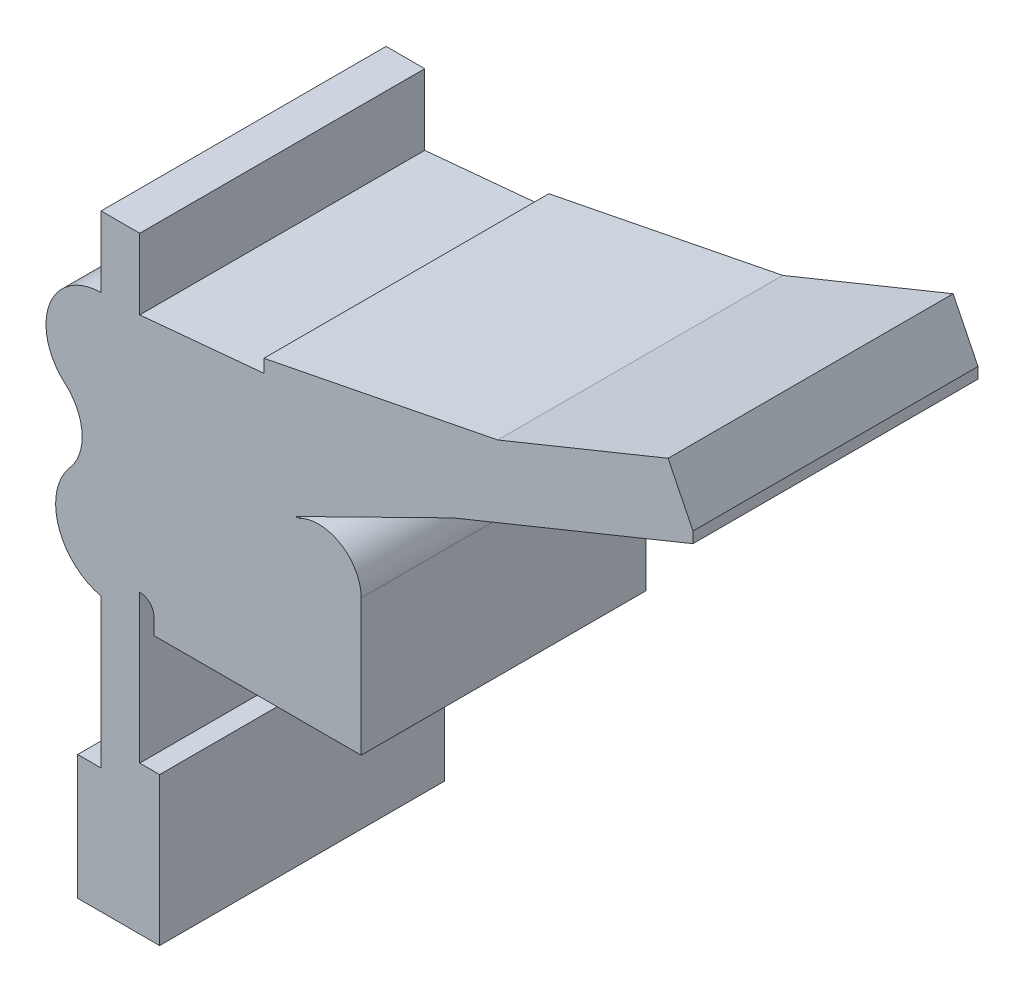
ISO-10303-21;
HEADER;
FILE_DESCRIPTION(('STEP AP214'),'2;1');
FILE_NAME('part.step','',(''),(''),'','','');
FILE_SCHEMA(('AUTOMOTIVE_DESIGN { 1 0 10303 214 1 1 1 1 }'));
ENDSEC;
DATA;
#1=APPLICATION_CONTEXT('core data for automotive mechanical design processes');
#2=APPLICATION_PROTOCOL_DEFINITION('international standard','automotive_design',2000,#1);
#3=PRODUCT_CONTEXT('',#1,'mechanical');
#4=PRODUCT('Part','Part','',(#3));
#5=PRODUCT_RELATED_PRODUCT_CATEGORY('part','',(#4));
#6=PRODUCT_DEFINITION_FORMATION('','',#4);
#7=PRODUCT_DEFINITION_CONTEXT('part definition',#1,'design');
#8=PRODUCT_DEFINITION('design','',#6,#7);
#9=PRODUCT_DEFINITION_SHAPE('','',#8);
#10=(LENGTH_UNIT() NAMED_UNIT(*) SI_UNIT(.MILLI.,.METRE.));
#11=(NAMED_UNIT(*) PLANE_ANGLE_UNIT() SI_UNIT($,.RADIAN.));
#12=(NAMED_UNIT(*) SI_UNIT($,.STERADIAN.) SOLID_ANGLE_UNIT());
#13=UNCERTAINTY_MEASURE_WITH_UNIT(LENGTH_MEASURE(1.E-05),#10,'distance_accuracy_value','');
#14=(GEOMETRIC_REPRESENTATION_CONTEXT(3) GLOBAL_UNCERTAINTY_ASSIGNED_CONTEXT((#13)) GLOBAL_UNIT_ASSIGNED_CONTEXT((#10,
#11,#12)) REPRESENTATION_CONTEXT('',''));
#15=CARTESIAN_POINT('',(0.,0.,0.));
#16=DIRECTION('',(0.,0.,1.));
#17=DIRECTION('',(1.,0.,0.));
#18=AXIS2_PLACEMENT_3D('',#15,#16,#17);
#19=CARTESIAN_POINT('',(141.836213574338,159.840975298499,59.));
#20=DIRECTION('',(-1.,0.,0.));
#21=DIRECTION('',(0.,0.,1.));
#22=AXIS2_PLACEMENT_3D('',#19,#20,#21);
#23=PLANE('',#22);
#24=DIRECTION('',(0.,1.,0.));
#25=VECTOR('',#24,1.);
#26=CARTESIAN_POINT('',(141.836213574338,159.840975298499,0.));
#27=LINE('',#26,#25);
#28=CARTESIAN_POINT('',(141.836213574338,159.840975298499,0.));
#29=VERTEX_POINT('',#28);
#30=CARTESIAN_POINT('',(141.836213574338,162.118956640308,0.));
#31=VERTEX_POINT('',#30);
#32=EDGE_CURVE('E245',#29,#31,#27,.T.);
#33=ORIENTED_EDGE('',*,*,#32,.T.);
#34=DIRECTION('',(0.,0.,-1.));
#35=VECTOR('',#34,1.);
#36=CARTESIAN_POINT('',(141.836213574338,162.118956640308,59.));
#37=LINE('',#36,#35);
#38=CARTESIAN_POINT('',(141.836213574338,162.118956640308,59.));
#39=VERTEX_POINT('',#38);
#40=EDGE_CURVE('E11',#39,#31,#37,.T.);
#41=ORIENTED_EDGE('',*,*,#40,.F.);
#42=DIRECTION('',(0.,1.,0.));
#43=VECTOR('',#42,1.);
#44=CARTESIAN_POINT('',(141.836213574338,159.840975298499,59.));
#45=LINE('',#44,#43);
#46=CARTESIAN_POINT('',(141.836213574338,159.840975298499,59.));
#47=VERTEX_POINT('',#46);
#48=EDGE_CURVE('E298',#47,#39,#45,.T.);
#49=ORIENTED_EDGE('',*,*,#48,.F.);
#50=DIRECTION('',(0.,0.,-1.));
#51=VECTOR('',#50,1.);
#52=CARTESIAN_POINT('',(141.836213574338,159.840975298499,59.));
#53=LINE('',#52,#51);
#54=EDGE_CURVE('E241',#47,#29,#53,.T.);
#55=ORIENTED_EDGE('',*,*,#54,.T.);
#56=EDGE_LOOP('',(#33,#41,#49,#55));
#57=FACE_BOUND('',#56,.T.);
#58=ADVANCED_FACE('F35',(#57),#23,.F.);
#59=CARTESIAN_POINT('',(141.836213574338,162.118956640308,59.));
#60=DIRECTION('',(-0.897170676040537,-0.441684025127654,0.));
#61=DIRECTION('',(0.441684025127654,-0.897170676040537,0.));
#62=AXIS2_PLACEMENT_3D('',#59,#60,#61);
#63=PLANE('',#62);
#64=DIRECTION('',(-0.441684025127654,0.897170676040537,0.));
#65=VECTOR('',#64,1.);
#66=CARTESIAN_POINT('',(141.836213574338,162.118956640308,0.));
#67=LINE('',#66,#65);
#68=CARTESIAN_POINT('',(136.686788286982,172.578726755251,0.));
#69=VERTEX_POINT('',#68);
#70=EDGE_CURVE('E248',#31,#69,#67,.T.);
#71=ORIENTED_EDGE('',*,*,#70,.T.);
#72=DIRECTION('',(0.,0.,-1.));
#73=VECTOR('',#72,1.);
#74=CARTESIAN_POINT('',(136.686788286982,172.578726755251,59.));
#75=LINE('',#74,#73);
#76=CARTESIAN_POINT('',(136.686788286982,172.578726755251,59.));
#77=VERTEX_POINT('',#76);
#78=EDGE_CURVE('E43',#77,#69,#75,.T.);
#79=ORIENTED_EDGE('',*,*,#78,.F.);
#80=DIRECTION('',(-0.441684025127654,0.897170676040537,0.));
#81=VECTOR('',#80,1.);
#82=CARTESIAN_POINT('',(141.836213574338,162.118956640308,59.));
#83=LINE('',#82,#81);
#84=EDGE_CURVE('E151',#39,#77,#83,.T.);
#85=ORIENTED_EDGE('',*,*,#84,.F.);
#86=ORIENTED_EDGE('',*,*,#40,.T.);
#87=EDGE_LOOP('',(#71,#79,#85,#86));
#88=FACE_BOUND('',#87,.T.);
#89=ADVANCED_FACE('F450',(#88),#63,.F.);
#90=CARTESIAN_POINT('',(136.686788286982,172.578726755251,59.));
#91=DIRECTION('',(0.376798129201933,-0.926295400954751,0.));
#92=DIRECTION('',(0.926295400954751,0.376798129201934,0.));
#93=AXIS2_PLACEMENT_3D('',#90,#91,#92);
#94=PLANE('',#93);
#95=DIRECTION('',(-0.926295400954751,-0.376798129201934,0.));
#96=VECTOR('',#95,1.);
#97=CARTESIAN_POINT('',(136.686788286982,172.578726755251,0.));
#98=LINE('',#97,#96);
#99=CARTESIAN_POINT('',(101.42242047089,158.233899169044,0.));
#100=VERTEX_POINT('',#99);
#101=EDGE_CURVE('E250',#69,#100,#98,.T.);
#102=ORIENTED_EDGE('',*,*,#101,.T.);
#103=DIRECTION('',(0.,0.,-1.));
#104=VECTOR('',#103,1.);
#105=CARTESIAN_POINT('',(101.42242047089,158.233899169044,59.));
#106=LINE('',#105,#104);
#107=CARTESIAN_POINT('',(101.42242047089,158.233899169044,59.));
#108=VERTEX_POINT('',#107);
#109=EDGE_CURVE('E362',#108,#100,#106,.T.);
#110=ORIENTED_EDGE('',*,*,#109,.F.);
#111=DIRECTION('',(-0.926295400954751,-0.376798129201934,0.));
#112=VECTOR('',#111,1.);
#113=CARTESIAN_POINT('',(136.686788286982,172.578726755251,59.));
#114=LINE('',#113,#112);
#115=EDGE_CURVE('E370',#77,#108,#114,.T.);
#116=ORIENTED_EDGE('',*,*,#115,.F.);
#117=ORIENTED_EDGE('',*,*,#78,.T.);
#118=EDGE_LOOP('',(#102,#110,#116,#117));
#119=FACE_BOUND('',#118,.T.);
#120=ADVANCED_FACE('F368',(#119),#94,.F.);
#121=CARTESIAN_POINT('',(101.42242047089,158.233899169044,59.));
#122=DIRECTION('',(0.19378641821299,-0.981043742203262,0.));
#123=DIRECTION('',(0.981043742203262,0.19378641821299,0.));
#124=AXIS2_PLACEMENT_3D('',#121,#122,#123);
#125=PLANE('',#124);
#126=DIRECTION('',(-0.981043742203262,-0.19378641821299,0.));
#127=VECTOR('',#126,1.);
#128=CARTESIAN_POINT('',(101.42242047089,158.233899169044,0.));
#129=LINE('',#128,#127);
#130=CARTESIAN_POINT('',(53.0086273674414,148.670680778239,0.));
#131=VERTEX_POINT('',#130);
#132=EDGE_CURVE('E252',#100,#131,#129,.T.);
#133=ORIENTED_EDGE('',*,*,#132,.T.);
#134=DIRECTION('',(0.,0.,-1.));
#135=VECTOR('',#134,1.);
#136=CARTESIAN_POINT('',(53.0086273674414,148.670680778239,59.));
#137=LINE('',#136,#135);
#138=CARTESIAN_POINT('',(53.0086273674414,148.670680778239,59.));
#139=VERTEX_POINT('',#138);
#140=EDGE_CURVE('E359',#139,#131,#137,.T.);
#141=ORIENTED_EDGE('',*,*,#140,.F.);
#142=DIRECTION('',(-0.981043742203262,-0.19378641821299,0.));
#143=VECTOR('',#142,1.);
#144=CARTESIAN_POINT('',(101.42242047089,158.233899169044,59.));
#145=LINE('',#144,#143);
#146=EDGE_CURVE('E388',#108,#139,#145,.T.);
#147=ORIENTED_EDGE('',*,*,#146,.F.);
#148=ORIENTED_EDGE('',*,*,#109,.T.);
#149=EDGE_LOOP('',(#133,#141,#147,#148));
#150=FACE_BOUND('',#149,.T.);
#151=ADVANCED_FACE('F379',(#150),#125,.F.);
#152=CARTESIAN_POINT('',(53.0086273674414,148.670680778239,59.));
#153=DIRECTION('',(1.,0.,0.));
#154=DIRECTION('',(0.,0.,-1.));
#155=AXIS2_PLACEMENT_3D('',#152,#153,#154);
#156=PLANE('',#155);
#157=DIRECTION('',(0.,-1.,0.));
#158=VECTOR('',#157,1.);
#159=CARTESIAN_POINT('',(53.0086273674414,148.670680778239,0.));
#160=LINE('',#159,#158);
#161=CARTESIAN_POINT('',(53.0086273674414,145.981025605825,0.));
#162=VERTEX_POINT('',#161);
#163=EDGE_CURVE('E254',#131,#162,#160,.T.);
#164=ORIENTED_EDGE('',*,*,#163,.T.);
#165=DIRECTION('',(0.,0.,-1.));
#166=VECTOR('',#165,1.);
#167=CARTESIAN_POINT('',(53.0086273674414,145.981025605825,59.));
#168=LINE('',#167,#166);
#169=CARTESIAN_POINT('',(53.0086273674414,145.981025605825,59.));
#170=VERTEX_POINT('',#169);
#171=EDGE_CURVE('E356',#170,#162,#168,.T.);
#172=ORIENTED_EDGE('',*,*,#171,.F.);
#173=DIRECTION('',(0.,-1.,0.));
#174=VECTOR('',#173,1.);
#175=CARTESIAN_POINT('',(53.0086273674414,148.670680778239,59.));
#176=LINE('',#175,#174);
#177=EDGE_CURVE('E385',#139,#170,#176,.T.);
#178=ORIENTED_EDGE('',*,*,#177,.F.);
#179=ORIENTED_EDGE('',*,*,#140,.T.);
#180=EDGE_LOOP('',(#164,#172,#178,#179));
#181=FACE_BOUND('',#180,.T.);
#182=ADVANCED_FACE('F383',(#181),#156,.F.);
#183=CARTESIAN_POINT('',(53.0086273674414,145.981025605825,59.));
#184=DIRECTION('',(0.0926233689294972,-0.995701215992102,0.));
#185=DIRECTION('',(0.995701215992102,0.0926233689294973,0.));
#186=AXIS2_PLACEMENT_3D('',#183,#184,#185);
#187=PLANE('',#186);
#188=DIRECTION('',(-0.995701215992102,-0.0926233689294972,0.));
#189=VECTOR('',#188,1.);
#190=CARTESIAN_POINT('',(53.0086273674414,145.981025605825,0.));
#191=LINE('',#190,#189);
#192=CARTESIAN_POINT('',(27.307477942154,143.590221008124,0.));
#193=VERTEX_POINT('',#192);
#194=EDGE_CURVE('E256',#162,#193,#191,.T.);
#195=ORIENTED_EDGE('',*,*,#194,.T.);
#196=DIRECTION('',(0.,0.,-1.));
#197=VECTOR('',#196,1.);
#198=CARTESIAN_POINT('',(27.307477942154,143.590221008124,59.));
#199=LINE('',#198,#197);
#200=CARTESIAN_POINT('',(27.307477942154,143.590221008124,59.));
#201=VERTEX_POINT('',#200);
#202=EDGE_CURVE('E353',#201,#193,#199,.T.);
#203=ORIENTED_EDGE('',*,*,#202,.F.);
#204=DIRECTION('',(-0.995701215992102,-0.0926233689294972,0.));
#205=VECTOR('',#204,1.);
#206=CARTESIAN_POINT('',(53.0086273674414,145.981025605825,59.));
#207=LINE('',#206,#205);
#208=EDGE_CURVE('E387',#170,#201,#207,.T.);
#209=ORIENTED_EDGE('',*,*,#208,.F.);
#210=ORIENTED_EDGE('',*,*,#171,.T.);
#211=EDGE_LOOP('',(#195,#203,#209,#210));
#212=FACE_BOUND('',#211,.T.);
#213=ADVANCED_FACE('F463',(#212),#187,.F.);
#214=CARTESIAN_POINT('',(27.307477942154,143.590221008124,59.));
#215=DIRECTION('',(-1.,0.,0.));
#216=DIRECTION('',(0.,0.,1.));
#217=AXIS2_PLACEMENT_3D('',#214,#215,#216);
#218=PLANE('',#217);
#219=DIRECTION('',(0.,1.,0.));
#220=VECTOR('',#219,1.);
#221=CARTESIAN_POINT('',(27.307477942154,143.590221008124,0.));
#222=LINE('',#221,#220);
#223=CARTESIAN_POINT('',(27.307477942154,158.233899169044,0.));
#224=VERTEX_POINT('',#223);
#225=EDGE_CURVE('E258',#193,#224,#222,.T.);
#226=ORIENTED_EDGE('',*,*,#225,.T.);
#227=DIRECTION('',(0.,0.,-1.));
#228=VECTOR('',#227,1.);
#229=CARTESIAN_POINT('',(27.307477942154,158.233899169044,59.));
#230=LINE('',#229,#228);
#231=CARTESIAN_POINT('',(27.307477942154,158.233899169044,59.));
#232=VERTEX_POINT('',#231);
#233=EDGE_CURVE('E350',#232,#224,#230,.T.);
#234=ORIENTED_EDGE('',*,*,#233,.F.);
#235=DIRECTION('',(0.,1.,0.));
#236=VECTOR('',#235,1.);
#237=CARTESIAN_POINT('',(27.307477942154,143.590221008124,59.));
#238=LINE('',#237,#236);
#239=EDGE_CURVE('E390',#201,#232,#238,.T.);
#240=ORIENTED_EDGE('',*,*,#239,.F.);
#241=ORIENTED_EDGE('',*,*,#202,.T.);
#242=EDGE_LOOP('',(#226,#234,#240,#241));
#243=FACE_BOUND('',#242,.T.);
#244=ADVANCED_FACE('F466',(#243),#218,.F.);
#245=CARTESIAN_POINT('',(27.307477942154,158.233899169044,59.));
#246=DIRECTION('',(0.,-1.,0.));
#247=DIRECTION('',(0.,0.,-1.));
#248=AXIS2_PLACEMENT_3D('',#245,#246,#247);
#249=PLANE('',#248);
#250=DIRECTION('',(-1.,0.,0.));
#251=VECTOR('',#250,1.);
#252=CARTESIAN_POINT('',(27.307477942154,158.233899169044,0.));
#253=LINE('',#252,#251);
#254=CARTESIAN_POINT('',(19.307477942154,158.233899169044,0.));
#255=VERTEX_POINT('',#254);
#256=EDGE_CURVE('E260',#224,#255,#253,.T.);
#257=ORIENTED_EDGE('',*,*,#256,.T.);
#258=DIRECTION('',(0.,0.,-1.));
#259=VECTOR('',#258,1.);
#260=CARTESIAN_POINT('',(19.307477942154,158.233899169044,59.));
#261=LINE('',#260,#259);
#262=CARTESIAN_POINT('',(19.307477942154,158.233899169044,59.));
#263=VERTEX_POINT('',#262);
#264=EDGE_CURVE('E347',#263,#255,#261,.T.);
#265=ORIENTED_EDGE('',*,*,#264,.F.);
#266=DIRECTION('',(-1.,0.,0.));
#267=VECTOR('',#266,1.);
#268=CARTESIAN_POINT('',(27.307477942154,158.233899169044,59.));
#269=LINE('',#268,#267);
#270=EDGE_CURVE('E396',#232,#263,#269,.T.);
#271=ORIENTED_EDGE('',*,*,#270,.F.);
#272=ORIENTED_EDGE('',*,*,#233,.T.);
#273=EDGE_LOOP('',(#257,#265,#271,#272));
#274=FACE_BOUND('',#273,.T.);
#275=ADVANCED_FACE('F470',(#274),#249,.F.);
#276=CARTESIAN_POINT('',(19.307477942154,158.233899169044,59.));
#277=DIRECTION('',(1.,0.,0.));
#278=DIRECTION('',(0.,0.,-1.));
#279=AXIS2_PLACEMENT_3D('',#276,#277,#278);
#280=PLANE('',#279);
#281=DIRECTION('',(0.,-1.,0.));
#282=VECTOR('',#281,1.);
#283=CARTESIAN_POINT('',(19.307477942154,158.233899169044,0.));
#284=LINE('',#283,#282);
#285=CARTESIAN_POINT('',(19.307477942154,143.590221008124,0.));
#286=VERTEX_POINT('',#285);
#287=EDGE_CURVE('E262',#255,#286,#284,.T.);
#288=ORIENTED_EDGE('',*,*,#287,.T.);
#289=DIRECTION('',(0.,0.,-1.));
#290=VECTOR('',#289,1.);
#291=CARTESIAN_POINT('',(19.307477942154,143.590221008124,59.));
#292=LINE('',#291,#290);
#293=CARTESIAN_POINT('',(19.307477942154,143.590221008124,59.));
#294=VERTEX_POINT('',#293);
#295=EDGE_CURVE('E344',#294,#286,#292,.T.);
#296=ORIENTED_EDGE('',*,*,#295,.F.);
#297=DIRECTION('',(0.,-1.,0.));
#298=VECTOR('',#297,1.);
#299=CARTESIAN_POINT('',(19.307477942154,158.233899169044,59.));
#300=LINE('',#299,#298);
#301=EDGE_CURVE('E398',#263,#294,#300,.T.);
#302=ORIENTED_EDGE('',*,*,#301,.F.);
#303=ORIENTED_EDGE('',*,*,#264,.T.);
#304=EDGE_LOOP('',(#288,#296,#302,#303));
#305=FACE_BOUND('',#304,.T.);
#306=ADVANCED_FACE('F474',(#305),#280,.F.);
#307=CARTESIAN_POINT('',(19.307477942154,132.184834149315,59.));
#308=DIRECTION('',(0.,0.,-1.));
#309=DIRECTION('',(-1.,0.,0.));
#310=AXIS2_PLACEMENT_3D('',#307,#308,#309);
#311=CYLINDRICAL_SURFACE('',#310,11.4053868588094);
#312=CARTESIAN_POINT('',(19.307477942154,132.184834149315,0.));
#313=DIRECTION('',(0.,0.,1.));
#314=DIRECTION('',(1.,0.,0.));
#315=AXIS2_PLACEMENT_3D('',#312,#313,#314);
#316=CIRCLE('',#315,11.4053868588094);
#317=CARTESIAN_POINT('',(11.8362135743379,123.567232502377,0.));
#318=VERTEX_POINT('',#317);
#319=EDGE_CURVE('E264',#286,#318,#316,.T.);
#320=ORIENTED_EDGE('',*,*,#319,.T.);
#321=DIRECTION('',(0.,0.,-1.));
#322=VECTOR('',#321,1.);
#323=CARTESIAN_POINT('',(11.8362135743379,123.567232502377,59.));
#324=LINE('',#323,#322);
#325=CARTESIAN_POINT('',(11.8362135743379,123.567232502377,59.));
#326=VERTEX_POINT('',#325);
#327=EDGE_CURVE('E341',#326,#318,#324,.T.);
#328=ORIENTED_EDGE('',*,*,#327,.F.);
#329=CARTESIAN_POINT('',(19.307477942154,132.184834149315,59.));
#330=DIRECTION('',(0.,0.,1.));
#331=DIRECTION('',(1.,0.,0.));
#332=AXIS2_PLACEMENT_3D('',#329,#330,#331);
#333=CIRCLE('',#332,11.4053868588094);
#334=EDGE_CURVE('E400',#294,#326,#333,.T.);
#335=ORIENTED_EDGE('',*,*,#334,.F.);
#336=ORIENTED_EDGE('',*,*,#295,.T.);
#337=EDGE_LOOP('',(#320,#328,#335,#336));
#338=FACE_BOUND('',#337,.T.);
#339=ADVANCED_FACE('F478',(#338),#311,.T.);
#340=CARTESIAN_POINT('',(5.08135617637519,115.775958178279,59.));
#341=DIRECTION('',(0.,0.,-1.));
#342=DIRECTION('',(-1.,0.,0.));
#343=AXIS2_PLACEMENT_3D('',#340,#341,#342);
#344=CYLINDRICAL_SURFACE('',#343,10.3117435024422);
#345=CARTESIAN_POINT('',(5.08135617637519,115.775958178279,0.));
#346=DIRECTION('',(0.,0.,-1.));
#347=DIRECTION('',(-1.,0.,0.));
#348=AXIS2_PLACEMENT_3D('',#345,#346,#347);
#349=CIRCLE('',#348,10.3117435024422);
#350=CARTESIAN_POINT('',(12.8726305004731,109.021100780316,0.));
#351=VERTEX_POINT('',#350);
#352=EDGE_CURVE('E266',#318,#351,#349,.T.);
#353=ORIENTED_EDGE('',*,*,#352,.T.);
#354=DIRECTION('',(0.,0.,-1.));
#355=VECTOR('',#354,1.);
#356=CARTESIAN_POINT('',(12.8726305004731,109.021100780316,59.));
#357=LINE('',#356,#355);
#358=CARTESIAN_POINT('',(12.8726305004731,109.021100780316,59.));
#359=VERTEX_POINT('',#358);
#360=EDGE_CURVE('E338',#359,#351,#357,.T.);
#361=ORIENTED_EDGE('',*,*,#360,.F.);
#362=CARTESIAN_POINT('',(5.08135617637519,115.775958178279,59.));
#363=DIRECTION('',(0.,0.,-1.));
#364=DIRECTION('',(-1.,0.,0.));
#365=AXIS2_PLACEMENT_3D('',#362,#363,#364);
#366=CIRCLE('',#365,10.3117435024422);
#367=EDGE_CURVE('E402',#326,#359,#366,.T.);
#368=ORIENTED_EDGE('',*,*,#367,.F.);
#369=ORIENTED_EDGE('',*,*,#327,.T.);
#370=EDGE_LOOP('',(#353,#361,#368,#369));
#371=FACE_BOUND('',#370,.T.);
#372=ADVANCED_FACE('F482',(#371),#344,.F.);
#373=CARTESIAN_POINT('',(22.0812897642577,101.037402919633,59.));
#374=DIRECTION('',(0.,0.,-1.));
#375=DIRECTION('',(-1.,0.,0.));
#376=AXIS2_PLACEMENT_3D('',#373,#374,#375);
#377=CYLINDRICAL_SURFACE('',#376,12.1876510028455);
#378=CARTESIAN_POINT('',(22.0812897642577,101.037402919633,0.));
#379=DIRECTION('',(0.,0.,1.));
#380=DIRECTION('',(1.,0.,0.));
#381=AXIS2_PLACEMENT_3D('',#378,#379,#380);
#382=CIRCLE('',#381,12.1876510028455);
#383=CARTESIAN_POINT('',(19.307477942154,89.1695975225637,0.));
#384=VERTEX_POINT('',#383);
#385=EDGE_CURVE('E268',#351,#384,#382,.T.);
#386=ORIENTED_EDGE('',*,*,#385,.T.);
#387=DIRECTION('',(0.,0.,-1.));
#388=VECTOR('',#387,1.);
#389=CARTESIAN_POINT('',(19.307477942154,89.1695975225637,59.));
#390=LINE('',#389,#388);
#391=CARTESIAN_POINT('',(19.307477942154,89.1695975225637,59.));
#392=VERTEX_POINT('',#391);
#393=EDGE_CURVE('E335',#392,#384,#390,.T.);
#394=ORIENTED_EDGE('',*,*,#393,.F.);
#395=CARTESIAN_POINT('',(22.0812897642577,101.037402919633,59.));
#396=DIRECTION('',(0.,0.,1.));
#397=DIRECTION('',(1.,0.,0.));
#398=AXIS2_PLACEMENT_3D('',#395,#396,#397);
#399=CIRCLE('',#398,12.1876510028455);
#400=EDGE_CURVE('E404',#359,#392,#399,.T.);
#401=ORIENTED_EDGE('',*,*,#400,.F.);
#402=ORIENTED_EDGE('',*,*,#360,.T.);
#403=EDGE_LOOP('',(#386,#394,#401,#402));
#404=FACE_BOUND('',#403,.T.);
#405=ADVANCED_FACE('F486',(#404),#377,.T.);
#406=CARTESIAN_POINT('',(19.307477942154,89.1695975225637,59.));
#407=DIRECTION('',(1.,0.,0.));
#408=DIRECTION('',(0.,1.,0.));
#409=AXIS2_PLACEMENT_3D('',#406,#407,#408);
#410=PLANE('',#409);
#411=DIRECTION('',(0.,-1.,0.));
#412=VECTOR('',#411,1.);
#413=CARTESIAN_POINT('',(19.307477942154,89.1695975225637,0.));
#414=LINE('',#413,#412);
#415=CARTESIAN_POINT('',(19.307477942154,58.3638362254525,0.));
#416=VERTEX_POINT('',#415);
#417=EDGE_CURVE('E270',#384,#416,#414,.T.);
#418=ORIENTED_EDGE('',*,*,#417,.T.);
#419=DIRECTION('',(0.,0.,-1.));
#420=VECTOR('',#419,1.);
#421=CARTESIAN_POINT('',(19.307477942154,58.3638362254525,59.));
#422=LINE('',#421,#420);
#423=CARTESIAN_POINT('',(19.307477942154,58.3638362254525,59.));
#424=VERTEX_POINT('',#423);
#425=EDGE_CURVE('E332',#424,#416,#422,.T.);
#426=ORIENTED_EDGE('',*,*,#425,.F.);
#427=DIRECTION('',(0.,-1.,0.));
#428=VECTOR('',#427,1.);
#429=CARTESIAN_POINT('',(19.307477942154,89.1695975225637,59.));
#430=LINE('',#429,#428);
#431=EDGE_CURVE('E406',#392,#424,#430,.T.);
#432=ORIENTED_EDGE('',*,*,#431,.F.);
#433=ORIENTED_EDGE('',*,*,#393,.T.);
#434=EDGE_LOOP('',(#418,#426,#432,#433));
#435=FACE_BOUND('',#434,.T.);
#436=ADVANCED_FACE('F490',(#435),#410,.F.);
#437=CARTESIAN_POINT('',(19.307477942154,58.3638362254525,59.));
#438=DIRECTION('',(0.,-1.,0.));
#439=DIRECTION('',(0.,0.,-1.));
#440=AXIS2_PLACEMENT_3D('',#437,#438,#439);
#441=PLANE('',#440);
#442=DIRECTION('',(-1.,0.,0.));
#443=VECTOR('',#442,1.);
#444=CARTESIAN_POINT('',(19.307477942154,58.3638362254525,0.));
#445=LINE('',#444,#443);
#446=CARTESIAN_POINT('',(14.4617570948156,58.3638362254525,0.));
#447=VERTEX_POINT('',#446);
#448=EDGE_CURVE('E272',#416,#447,#445,.T.);
#449=ORIENTED_EDGE('',*,*,#448,.T.);
#450=DIRECTION('',(0.,0.,-1.));
#451=VECTOR('',#450,1.);
#452=CARTESIAN_POINT('',(14.4617570948156,58.3638362254525,59.));
#453=LINE('',#452,#451);
#454=CARTESIAN_POINT('',(14.4617570948156,58.3638362254525,59.));
#455=VERTEX_POINT('',#454);
#456=EDGE_CURVE('E329',#455,#447,#453,.T.);
#457=ORIENTED_EDGE('',*,*,#456,.F.);
#458=DIRECTION('',(-1.,0.,0.));
#459=VECTOR('',#458,1.);
#460=CARTESIAN_POINT('',(19.307477942154,58.3638362254525,59.));
#461=LINE('',#460,#459);
#462=EDGE_CURVE('E408',#424,#455,#461,.T.);
#463=ORIENTED_EDGE('',*,*,#462,.F.);
#464=ORIENTED_EDGE('',*,*,#425,.T.);
#465=EDGE_LOOP('',(#449,#457,#463,#464));
#466=FACE_BOUND('',#465,.T.);
#467=ADVANCED_FACE('F494',(#466),#441,.F.);
#468=CARTESIAN_POINT('',(14.4617570948156,58.3638362254525,59.));
#469=DIRECTION('',(1.,0.,0.));
#470=DIRECTION('',(0.,1.,0.));
#471=AXIS2_PLACEMENT_3D('',#468,#469,#470);
#472=PLANE('',#471);
#473=DIRECTION('',(0.,-1.,0.));
#474=VECTOR('',#473,1.);
#475=CARTESIAN_POINT('',(14.4617570948156,58.3638362254525,0.));
#476=LINE('',#475,#474);
#477=CARTESIAN_POINT('',(14.4617570948156,32.5787267552506,0.));
#478=VERTEX_POINT('',#477);
#479=EDGE_CURVE('E274',#447,#478,#476,.T.);
#480=ORIENTED_EDGE('',*,*,#479,.T.);
#481=DIRECTION('',(0.,0.,-1.));
#482=VECTOR('',#481,1.);
#483=CARTESIAN_POINT('',(14.4617570948156,32.5787267552506,59.));
#484=LINE('',#483,#482);
#485=CARTESIAN_POINT('',(14.4617570948156,32.5787267552506,59.));
#486=VERTEX_POINT('',#485);
#487=EDGE_CURVE('E326',#486,#478,#484,.T.);
#488=ORIENTED_EDGE('',*,*,#487,.F.);
#489=DIRECTION('',(0.,-1.,0.));
#490=VECTOR('',#489,1.);
#491=CARTESIAN_POINT('',(14.4617570948156,58.3638362254525,59.));
#492=LINE('',#491,#490);
#493=EDGE_CURVE('E410',#455,#486,#492,.T.);
#494=ORIENTED_EDGE('',*,*,#493,.F.);
#495=ORIENTED_EDGE('',*,*,#456,.T.);
#496=EDGE_LOOP('',(#480,#488,#494,#495));
#497=FACE_BOUND('',#496,.T.);
#498=ADVANCED_FACE('F498',(#497),#472,.F.);
#499=CARTESIAN_POINT('',(14.4617570948156,32.5787267552506,59.));
#500=DIRECTION('',(0.,1.,0.));
#501=DIRECTION('',(0.,0.,1.));
#502=AXIS2_PLACEMENT_3D('',#499,#500,#501);
#503=PLANE('',#502);
#504=DIRECTION('',(1.,0.,0.));
#505=VECTOR('',#504,1.);
#506=CARTESIAN_POINT('',(14.4617570948156,32.5787267552506,0.));
#507=LINE('',#506,#505);
#508=CARTESIAN_POINT('',(31.4231010878512,32.5787267552506,0.));
#509=VERTEX_POINT('',#508);
#510=EDGE_CURVE('E276',#478,#509,#507,.T.);
#511=ORIENTED_EDGE('',*,*,#510,.T.);
#512=DIRECTION('',(0.,0.,-1.));
#513=VECTOR('',#512,1.);
#514=CARTESIAN_POINT('',(31.4231010878512,32.5787267552506,59.));
#515=LINE('',#514,#513);
#516=CARTESIAN_POINT('',(31.4231010878512,32.5787267552506,59.));
#517=VERTEX_POINT('',#516);
#518=EDGE_CURVE('E323',#517,#509,#515,.T.);
#519=ORIENTED_EDGE('',*,*,#518,.F.);
#520=DIRECTION('',(1.,0.,0.));
#521=VECTOR('',#520,1.);
#522=CARTESIAN_POINT('',(14.4617570948156,32.5787267552506,59.));
#523=LINE('',#522,#521);
#524=EDGE_CURVE('E412',#486,#517,#523,.T.);
#525=ORIENTED_EDGE('',*,*,#524,.F.);
#526=ORIENTED_EDGE('',*,*,#487,.T.);
#527=EDGE_LOOP('',(#511,#519,#525,#526));
#528=FACE_BOUND('',#527,.T.);
#529=ADVANCED_FACE('F502',(#528),#503,.F.);
#530=CARTESIAN_POINT('',(31.4231010878512,32.5787267552506,59.));
#531=DIRECTION('',(-1.,0.,0.));
#532=DIRECTION('',(0.,0.,1.));
#533=AXIS2_PLACEMENT_3D('',#530,#531,#532);
#534=PLANE('',#533);
#535=DIRECTION('',(0.,1.,0.));
#536=VECTOR('',#535,1.);
#537=CARTESIAN_POINT('',(31.4231010878512,32.5787267552506,0.));
#538=LINE('',#537,#536);
#539=CARTESIAN_POINT('',(31.4231010878512,63.2425778289277,0.));
#540=VERTEX_POINT('',#539);
#541=EDGE_CURVE('E278',#509,#540,#538,.T.);
#542=ORIENTED_EDGE('',*,*,#541,.T.);
#543=DIRECTION('',(0.,0.,-1.));
#544=VECTOR('',#543,1.);
#545=CARTESIAN_POINT('',(31.4231010878512,63.2425778289277,59.));
#546=LINE('',#545,#544);
#547=CARTESIAN_POINT('',(31.4231010878512,63.2425778289277,59.));
#548=VERTEX_POINT('',#547);
#549=EDGE_CURVE('E320',#548,#540,#546,.T.);
#550=ORIENTED_EDGE('',*,*,#549,.F.);
#551=DIRECTION('',(0.,1.,0.));
#552=VECTOR('',#551,1.);
#553=CARTESIAN_POINT('',(31.4231010878512,32.5787267552506,59.));
#554=LINE('',#553,#552);
#555=EDGE_CURVE('E414',#517,#548,#554,.T.);
#556=ORIENTED_EDGE('',*,*,#555,.F.);
#557=ORIENTED_EDGE('',*,*,#518,.T.);
#558=EDGE_LOOP('',(#542,#550,#556,#557));
#559=FACE_BOUND('',#558,.T.);
#560=ADVANCED_FACE('F506',(#559),#534,.F.);
#561=CARTESIAN_POINT('',(31.4231010878512,63.2425778289277,59.));
#562=DIRECTION('',(0.,-1.,0.));
#563=DIRECTION('',(0.,0.,-1.));
#564=AXIS2_PLACEMENT_3D('',#561,#562,#563);
#565=PLANE('',#564);
#566=DIRECTION('',(-1.,0.,0.));
#567=VECTOR('',#566,1.);
#568=CARTESIAN_POINT('',(31.4231010878512,63.2425778289277,0.));
#569=LINE('',#568,#567);
#570=CARTESIAN_POINT('',(27.307477942154,63.2425778289277,0.));
#571=VERTEX_POINT('',#570);
#572=EDGE_CURVE('E280',#540,#571,#569,.T.);
#573=ORIENTED_EDGE('',*,*,#572,.T.);
#574=DIRECTION('',(0.,0.,-1.));
#575=VECTOR('',#574,1.);
#576=CARTESIAN_POINT('',(27.307477942154,63.2425778289277,59.));
#577=LINE('',#576,#575);
#578=CARTESIAN_POINT('',(27.307477942154,63.2425778289277,59.));
#579=VERTEX_POINT('',#578);
#580=EDGE_CURVE('E317',#579,#571,#577,.T.);
#581=ORIENTED_EDGE('',*,*,#580,.F.);
#582=DIRECTION('',(-1.,0.,0.));
#583=VECTOR('',#582,1.);
#584=CARTESIAN_POINT('',(31.4231010878512,63.2425778289277,59.));
#585=LINE('',#584,#583);
#586=EDGE_CURVE('E416',#548,#579,#585,.T.);
#587=ORIENTED_EDGE('',*,*,#586,.F.);
#588=ORIENTED_EDGE('',*,*,#549,.T.);
#589=EDGE_LOOP('',(#573,#581,#587,#588));
#590=FACE_BOUND('',#589,.T.);
#591=ADVANCED_FACE('F510',(#590),#565,.F.);
#592=CARTESIAN_POINT('',(27.307477942154,63.2425778289277,59.));
#593=DIRECTION('',(-1.,0.,0.));
#594=DIRECTION('',(0.,0.,1.));
#595=AXIS2_PLACEMENT_3D('',#592,#593,#594);
#596=PLANE('',#595);
#597=DIRECTION('',(0.,1.,0.));
#598=VECTOR('',#597,1.);
#599=CARTESIAN_POINT('',(27.307477942154,63.2425778289277,0.));
#600=LINE('',#599,#598);
#601=CARTESIAN_POINT('',(27.307477942154,93.887357850838,0.));
#602=VERTEX_POINT('',#601);
#603=EDGE_CURVE('E282',#571,#602,#600,.T.);
#604=ORIENTED_EDGE('',*,*,#603,.T.);
#605=DIRECTION('',(0.,0.,-1.));
#606=VECTOR('',#605,1.);
#607=CARTESIAN_POINT('',(27.307477942154,93.887357850838,59.));
#608=LINE('',#607,#606);
#609=CARTESIAN_POINT('',(27.307477942154,93.887357850838,59.));
#610=VERTEX_POINT('',#609);
#611=EDGE_CURVE('E314',#610,#602,#608,.T.);
#612=ORIENTED_EDGE('',*,*,#611,.F.);
#613=DIRECTION('',(0.,1.,0.));
#614=VECTOR('',#613,1.);
#615=CARTESIAN_POINT('',(27.307477942154,63.2425778289277,59.));
#616=LINE('',#615,#614);
#617=EDGE_CURVE('E418',#579,#610,#616,.T.);
#618=ORIENTED_EDGE('',*,*,#617,.F.);
#619=ORIENTED_EDGE('',*,*,#580,.T.);
#620=EDGE_LOOP('',(#604,#612,#618,#619));
#621=FACE_BOUND('',#620,.T.);
#622=ADVANCED_FACE('F514',(#621),#596,.F.);
#623=CARTESIAN_POINT('',(27.307477942154,90.9428498639036,59.));
#624=DIRECTION('',(0.,0.,-1.));
#625=DIRECTION('',(-1.,0.,0.));
#626=AXIS2_PLACEMENT_3D('',#623,#624,#625);
#627=CYLINDRICAL_SURFACE('',#626,2.94450798693437);
#628=CARTESIAN_POINT('',(27.307477942154,90.9428498639036,0.));
#629=DIRECTION('',(0.,0.,-1.));
#630=DIRECTION('',(-1.,0.,0.));
#631=AXIS2_PLACEMENT_3D('',#628,#629,#630);
#632=CIRCLE('',#631,2.94450798693437);
#633=CARTESIAN_POINT('',(30.2519859290884,90.9428498639036,0.));
#634=VERTEX_POINT('',#633);
#635=EDGE_CURVE('E284',#602,#634,#632,.T.);
#636=ORIENTED_EDGE('',*,*,#635,.T.);
#637=DIRECTION('',(0.,0.,-1.));
#638=VECTOR('',#637,1.);
#639=CARTESIAN_POINT('',(30.2519859290884,90.9428498639036,59.));
#640=LINE('',#639,#638);
#641=CARTESIAN_POINT('',(30.2519859290884,90.9428498639036,59.));
#642=VERTEX_POINT('',#641);
#643=EDGE_CURVE('E311',#642,#634,#640,.T.);
#644=ORIENTED_EDGE('',*,*,#643,.F.);
#645=CARTESIAN_POINT('',(27.307477942154,90.9428498639036,59.));
#646=DIRECTION('',(0.,0.,-1.));
#647=DIRECTION('',(-1.,0.,0.));
#648=AXIS2_PLACEMENT_3D('',#645,#646,#647);
#649=CIRCLE('',#648,2.94450798693437);
#650=EDGE_CURVE('E420',#610,#642,#649,.T.);
#651=ORIENTED_EDGE('',*,*,#650,.F.);
#652=ORIENTED_EDGE('',*,*,#611,.T.);
#653=EDGE_LOOP('',(#636,#644,#651,#652));
#654=FACE_BOUND('',#653,.T.);
#655=ADVANCED_FACE('F518',(#654),#627,.F.);
#656=CARTESIAN_POINT('',(30.2519859290884,90.9428498639036,59.));
#657=DIRECTION('',(1.,0.,0.));
#658=DIRECTION('',(0.,0.,-1.));
#659=AXIS2_PLACEMENT_3D('',#656,#657,#658);
#660=PLANE('',#659);
#661=DIRECTION('',(0.,-1.,0.));
#662=VECTOR('',#661,1.);
#663=CARTESIAN_POINT('',(30.2519859290884,90.9428498639036,0.));
#664=LINE('',#663,#662);
#665=CARTESIAN_POINT('',(30.2519859290884,87.5787267552506,0.));
#666=VERTEX_POINT('',#665);
#667=EDGE_CURVE('E286',#634,#666,#664,.T.);
#668=ORIENTED_EDGE('',*,*,#667,.T.);
#669=DIRECTION('',(0.,0.,-1.));
#670=VECTOR('',#669,1.);
#671=CARTESIAN_POINT('',(30.2519859290884,87.5787267552506,59.));
#672=LINE('',#671,#670);
#673=CARTESIAN_POINT('',(30.2519859290884,87.5787267552506,59.));
#674=VERTEX_POINT('',#673);
#675=EDGE_CURVE('E308',#674,#666,#672,.T.);
#676=ORIENTED_EDGE('',*,*,#675,.F.);
#677=DIRECTION('',(0.,-1.,0.));
#678=VECTOR('',#677,1.);
#679=CARTESIAN_POINT('',(30.2519859290884,90.9428498639036,59.));
#680=LINE('',#679,#678);
#681=EDGE_CURVE('E422',#642,#674,#680,.T.);
#682=ORIENTED_EDGE('',*,*,#681,.F.);
#683=ORIENTED_EDGE('',*,*,#643,.T.);
#684=EDGE_LOOP('',(#668,#676,#682,#683));
#685=FACE_BOUND('',#684,.T.);
#686=ADVANCED_FACE('F522',(#685),#660,.F.);
#687=CARTESIAN_POINT('',(30.2519859290884,87.5787267552506,59.));
#688=DIRECTION('',(0.,1.,0.));
#689=DIRECTION('',(0.,0.,1.));
#690=AXIS2_PLACEMENT_3D('',#687,#688,#689);
#691=PLANE('',#690);
#692=DIRECTION('',(1.,0.,0.));
#693=VECTOR('',#692,1.);
#694=CARTESIAN_POINT('',(30.2519859290884,87.5787267552506,0.));
#695=LINE('',#694,#693);
#696=CARTESIAN_POINT('',(73.1511575214099,87.5787267552506,0.));
#697=VERTEX_POINT('',#696);
#698=EDGE_CURVE('E288',#666,#697,#695,.T.);
#699=ORIENTED_EDGE('',*,*,#698,.T.);
#700=DIRECTION('',(0.,0.,-1.));
#701=VECTOR('',#700,1.);
#702=CARTESIAN_POINT('',(73.1511575214099,87.5787267552506,59.));
#703=LINE('',#702,#701);
#704=CARTESIAN_POINT('',(73.1511575214099,87.5787267552506,59.));
#705=VERTEX_POINT('',#704);
#706=EDGE_CURVE('E305',#705,#697,#703,.T.);
#707=ORIENTED_EDGE('',*,*,#706,.F.);
#708=DIRECTION('',(1.,0.,0.));
#709=VECTOR('',#708,1.);
#710=CARTESIAN_POINT('',(30.2519859290884,87.5787267552506,59.));
#711=LINE('',#710,#709);
#712=EDGE_CURVE('E424',#674,#705,#711,.T.);
#713=ORIENTED_EDGE('',*,*,#712,.F.);
#714=ORIENTED_EDGE('',*,*,#675,.T.);
#715=EDGE_LOOP('',(#699,#707,#713,#714));
#716=FACE_BOUND('',#715,.T.);
#717=ADVANCED_FACE('F526',(#716),#691,.F.);
#718=CARTESIAN_POINT('',(73.1511575214099,91.5787267552506,59.));
#719=DIRECTION('',(-1.,0.,0.));
#720=DIRECTION('',(0.,-1.,0.));
#721=AXIS2_PLACEMENT_3D('',#718,#719,#720);
#722=PLANE('',#721);
#723=DIRECTION('',(0.,1.,0.));
#724=VECTOR('',#723,1.);
#725=CARTESIAN_POINT('',(73.1511575214099,91.5787267552506,0.));
#726=LINE('',#725,#724);
#727=CARTESIAN_POINT('',(73.1511575214099,115.775958178279,0.));
#728=VERTEX_POINT('',#727);
#729=EDGE_CURVE('E291',#697,#728,#726,.T.);
#730=ORIENTED_EDGE('',*,*,#729,.T.);
#731=DIRECTION('',(0.,0.,-1.));
#732=VECTOR('',#731,1.);
#733=CARTESIAN_POINT('',(73.1511575214099,115.775958178279,59.));
#734=LINE('',#733,#732);
#735=CARTESIAN_POINT('',(73.1511575214099,115.775958178279,59.));
#736=VERTEX_POINT('',#735);
#737=EDGE_CURVE('E302',#736,#728,#734,.T.);
#738=ORIENTED_EDGE('',*,*,#737,.F.);
#739=DIRECTION('',(0.,1.,0.));
#740=VECTOR('',#739,1.);
#741=CARTESIAN_POINT('',(73.1511575214099,87.5787267552506,59.));
#742=LINE('',#741,#740);
#743=EDGE_CURVE('E426',#705,#736,#742,.T.);
#744=ORIENTED_EDGE('',*,*,#743,.F.);
#745=ORIENTED_EDGE('',*,*,#706,.T.);
#746=EDGE_LOOP('',(#730,#738,#744,#745));
#747=FACE_BOUND('',#746,.T.);
#748=ADVANCED_FACE('F432',(#747),#722,.F.);
#749=CARTESIAN_POINT('',(64.3153201201433,115.775958178279,59.));
#750=DIRECTION('',(0.,0.,-1.));
#751=DIRECTION('',(-1.,0.,0.));
#752=AXIS2_PLACEMENT_3D('',#749,#750,#751);
#753=CYLINDRICAL_SURFACE('',#752,8.83583740126655);
#754=CARTESIAN_POINT('',(64.3153201201433,115.775958178279,0.));
#755=DIRECTION('',(0.,0.,1.));
#756=DIRECTION('',(1.,0.,0.));
#757=AXIS2_PLACEMENT_3D('',#754,#755,#756);
#758=CIRCLE('',#757,8.83583740126655);
#759=CARTESIAN_POINT('',(60.1478188318083,123.567232502377,0.));
#760=VERTEX_POINT('',#759);
#761=EDGE_CURVE('E293',#728,#760,#758,.T.);
#762=ORIENTED_EDGE('',*,*,#761,.T.);
#763=DIRECTION('',(0.,0.,-1.));
#764=VECTOR('',#763,1.);
#765=CARTESIAN_POINT('',(60.1478188318083,123.567232502377,59.));
#766=LINE('',#765,#764);
#767=CARTESIAN_POINT('',(60.1478188318083,123.567232502377,59.));
#768=VERTEX_POINT('',#767);
#769=EDGE_CURVE('E236',#768,#760,#766,.T.);
#770=ORIENTED_EDGE('',*,*,#769,.F.);
#771=CARTESIAN_POINT('',(64.3153201201433,115.775958178279,59.));
#772=DIRECTION('',(0.,0.,1.));
#773=DIRECTION('',(1.,0.,0.));
#774=AXIS2_PLACEMENT_3D('',#771,#772,#773);
#775=CIRCLE('',#774,8.83583740126655);
#776=EDGE_CURVE('E227',#736,#768,#775,.T.);
#777=ORIENTED_EDGE('',*,*,#776,.F.);
#778=ORIENTED_EDGE('',*,*,#737,.T.);
#779=EDGE_LOOP('',(#762,#770,#777,#778));
#780=FACE_BOUND('',#779,.T.);
#781=ADVANCED_FACE('F435',(#780),#753,.T.);
#782=CARTESIAN_POINT('',(60.1478188318083,123.567232502377,59.));
#783=DIRECTION('',(0.,-1.,0.));
#784=DIRECTION('',(0.,0.,-1.));
#785=AXIS2_PLACEMENT_3D('',#782,#783,#784);
#786=PLANE('',#785);
#787=DIRECTION('',(-1.,0.,0.));
#788=VECTOR('',#787,1.);
#789=CARTESIAN_POINT('',(60.1478188318083,123.567232502377,0.));
#790=LINE('',#789,#788);
#791=CARTESIAN_POINT('',(59.5309920573499,123.567232502377,0.));
#792=VERTEX_POINT('',#791);
#793=EDGE_CURVE('E235',#760,#792,#790,.T.);
#794=ORIENTED_EDGE('',*,*,#793,.T.);
#795=DIRECTION('',(0.,0.,-1.));
#796=VECTOR('',#795,1.);
#797=CARTESIAN_POINT('',(59.5309920573499,123.567232502377,59.));
#798=LINE('',#797,#796);
#799=CARTESIAN_POINT('',(59.5309920573499,123.567232502377,59.));
#800=VERTEX_POINT('',#799);
#801=EDGE_CURVE('E232',#800,#792,#798,.T.);
#802=ORIENTED_EDGE('',*,*,#801,.F.);
#803=DIRECTION('',(-1.,0.,0.));
#804=VECTOR('',#803,1.);
#805=CARTESIAN_POINT('',(60.1478188318083,123.567232502377,59.));
#806=LINE('',#805,#804);
#807=EDGE_CURVE('E221',#768,#800,#806,.T.);
#808=ORIENTED_EDGE('',*,*,#807,.F.);
#809=ORIENTED_EDGE('',*,*,#769,.T.);
#810=EDGE_LOOP('',(#794,#802,#808,#809));
#811=FACE_BOUND('',#810,.T.);
#812=ADVANCED_FACE('F233',(#811),#786,.F.);
#813=CARTESIAN_POINT('',(59.5309920573499,123.567232502377,59.));
#814=DIRECTION('',(-0.441684025127654,0.897170676040537,0.));
#815=DIRECTION('',(-0.897170676040537,-0.441684025127654,0.));
#816=AXIS2_PLACEMENT_3D('',#813,#814,#815);
#817=PLANE('',#816);
#818=DIRECTION('',(0.897170676040537,0.441684025127654,0.));
#819=VECTOR('',#818,1.);
#820=CARTESIAN_POINT('',(59.5309920573499,123.567232502377,0.));
#821=LINE('',#820,#819);
#822=CARTESIAN_POINT('',(92.1945836934039,139.647769923204,0.));
#823=VERTEX_POINT('',#822);
#824=EDGE_CURVE('E137',#792,#823,#821,.T.);
#825=ORIENTED_EDGE('',*,*,#824,.T.);
#826=DIRECTION('',(0.,0.,-1.));
#827=VECTOR('',#826,1.);
#828=CARTESIAN_POINT('',(92.1945836934039,139.647769923204,59.));
#829=LINE('',#828,#827);
#830=CARTESIAN_POINT('',(92.1945836934039,139.647769923204,59.));
#831=VERTEX_POINT('',#830);
#832=EDGE_CURVE('E237',#831,#823,#829,.T.);
#833=ORIENTED_EDGE('',*,*,#832,.F.);
#834=DIRECTION('',(0.897170676040537,0.441684025127654,0.));
#835=VECTOR('',#834,1.);
#836=CARTESIAN_POINT('',(59.5309920573499,123.567232502377,59.));
#837=LINE('',#836,#835);
#838=EDGE_CURVE('E225',#800,#831,#837,.T.);
#839=ORIENTED_EDGE('',*,*,#838,.F.);
#840=ORIENTED_EDGE('',*,*,#801,.T.);
#841=EDGE_LOOP('',(#825,#833,#839,#840));
#842=FACE_BOUND('',#841,.T.);
#843=ADVANCED_FACE('F239',(#842),#817,.F.);
#844=CARTESIAN_POINT('',(92.1945836934039,139.647769923204,59.));
#845=DIRECTION('',(-0.376798129201933,0.926295400954751,0.));
#846=DIRECTION('',(-0.926295400954751,-0.376798129201933,0.));
#847=AXIS2_PLACEMENT_3D('',#844,#845,#846);
#848=PLANE('',#847);
#849=DIRECTION('',(0.926295400954751,0.376798129201933,0.));
#850=VECTOR('',#849,1.);
#851=CARTESIAN_POINT('',(92.1945836934039,139.647769923204,0.));
#852=LINE('',#851,#850);
#853=EDGE_CURVE('E143',#823,#29,#852,.T.);
#854=ORIENTED_EDGE('',*,*,#853,.T.);
#855=ORIENTED_EDGE('',*,*,#54,.F.);
#856=DIRECTION('',(0.926295400954751,0.376798129201933,0.));
#857=VECTOR('',#856,1.);
#858=CARTESIAN_POINT('',(92.1945836934039,139.647769923204,59.));
#859=LINE('',#858,#857);
#860=EDGE_CURVE('E51',#831,#47,#859,.T.);
#861=ORIENTED_EDGE('',*,*,#860,.F.);
#862=ORIENTED_EDGE('',*,*,#832,.T.);
#863=EDGE_LOOP('',(#854,#855,#861,#862));
#864=FACE_BOUND('',#863,.T.);
#865=ADVANCED_FACE('F439',(#864),#848,.F.);
#866=CARTESIAN_POINT('',(19.307477942154,132.184834149315,59.));
#867=DIRECTION('',(0.,0.,1.));
#868=DIRECTION('',(1.,0.,0.));
#869=AXIS2_PLACEMENT_3D('',#866,#867,#868);
#870=PLANE('',#869);
#871=ORIENTED_EDGE('',*,*,#48,.T.);
#872=ORIENTED_EDGE('',*,*,#84,.T.);
#873=ORIENTED_EDGE('',*,*,#115,.T.);
#874=ORIENTED_EDGE('',*,*,#146,.T.);
#875=ORIENTED_EDGE('',*,*,#177,.T.);
#876=ORIENTED_EDGE('',*,*,#208,.T.);
#877=ORIENTED_EDGE('',*,*,#239,.T.);
#878=ORIENTED_EDGE('',*,*,#270,.T.);
#879=ORIENTED_EDGE('',*,*,#301,.T.);
#880=ORIENTED_EDGE('',*,*,#334,.T.);
#881=ORIENTED_EDGE('',*,*,#367,.T.);
#882=ORIENTED_EDGE('',*,*,#400,.T.);
#883=ORIENTED_EDGE('',*,*,#431,.T.);
#884=ORIENTED_EDGE('',*,*,#462,.T.);
#885=ORIENTED_EDGE('',*,*,#493,.T.);
#886=ORIENTED_EDGE('',*,*,#524,.T.);
#887=ORIENTED_EDGE('',*,*,#555,.T.);
#888=ORIENTED_EDGE('',*,*,#586,.T.);
#889=ORIENTED_EDGE('',*,*,#617,.T.);
#890=ORIENTED_EDGE('',*,*,#650,.T.);
#891=ORIENTED_EDGE('',*,*,#681,.T.);
#892=ORIENTED_EDGE('',*,*,#712,.T.);
#893=ORIENTED_EDGE('',*,*,#743,.T.);
#894=ORIENTED_EDGE('',*,*,#776,.T.);
#895=ORIENTED_EDGE('',*,*,#807,.T.);
#896=ORIENTED_EDGE('',*,*,#838,.T.);
#897=ORIENTED_EDGE('',*,*,#860,.T.);
#898=EDGE_LOOP('',(#871,#872,#873,#874,#875,#876,#877,#878,#879,#880,#881,#882,#883,#884,#885,
#886,#887,#888,#889,#890,#891,#892,#893,#894,#895,#896,#897));
#899=FACE_BOUND('',#898,.T.);
#900=ADVANCED_FACE('F223',(#899),#870,.T.);
#901=CARTESIAN_POINT('',(19.307477942154,132.184834149315,0.));
#902=DIRECTION('',(0.,0.,1.));
#903=DIRECTION('',(1.,0.,0.));
#904=AXIS2_PLACEMENT_3D('',#901,#902,#903);
#905=PLANE('',#904);
#906=ORIENTED_EDGE('',*,*,#32,.F.);
#907=ORIENTED_EDGE('',*,*,#853,.F.);
#908=ORIENTED_EDGE('',*,*,#824,.F.);
#909=ORIENTED_EDGE('',*,*,#793,.F.);
#910=ORIENTED_EDGE('',*,*,#761,.F.);
#911=ORIENTED_EDGE('',*,*,#729,.F.);
#912=ORIENTED_EDGE('',*,*,#698,.F.);
#913=ORIENTED_EDGE('',*,*,#667,.F.);
#914=ORIENTED_EDGE('',*,*,#635,.F.);
#915=ORIENTED_EDGE('',*,*,#603,.F.);
#916=ORIENTED_EDGE('',*,*,#572,.F.);
#917=ORIENTED_EDGE('',*,*,#541,.F.);
#918=ORIENTED_EDGE('',*,*,#510,.F.);
#919=ORIENTED_EDGE('',*,*,#479,.F.);
#920=ORIENTED_EDGE('',*,*,#448,.F.);
#921=ORIENTED_EDGE('',*,*,#417,.F.);
#922=ORIENTED_EDGE('',*,*,#385,.F.);
#923=ORIENTED_EDGE('',*,*,#352,.F.);
#924=ORIENTED_EDGE('',*,*,#319,.F.);
#925=ORIENTED_EDGE('',*,*,#287,.F.);
#926=ORIENTED_EDGE('',*,*,#256,.F.);
#927=ORIENTED_EDGE('',*,*,#225,.F.);
#928=ORIENTED_EDGE('',*,*,#194,.F.);
#929=ORIENTED_EDGE('',*,*,#163,.F.);
#930=ORIENTED_EDGE('',*,*,#132,.F.);
#931=ORIENTED_EDGE('',*,*,#101,.F.);
#932=ORIENTED_EDGE('',*,*,#70,.F.);
#933=EDGE_LOOP('',(#906,#907,#908,#909,#910,#911,#912,#913,#914,#915,#916,#917,#918,#919,#920,
#921,#922,#923,#924,#925,#926,#927,#928,#929,#930,#931,#932));
#934=FACE_BOUND('',#933,.T.);
#935=ADVANCED_FACE('F374',(#934),#905,.F.);
#936=CLOSED_SHELL('',(#58,#89,#120,#151,#182,#213,#244,#275,#306,#339,#372,#405,#436,#467,#498,
#529,#560,#591,#622,#655,#686,#717,#748,#781,#812,#843,#865,#900,#935));
#937=MANIFOLD_SOLID_BREP('B2',#936);
#938=ADVANCED_BREP_SHAPE_REPRESENTATION('',(#18,#937),#14);
#939=SHAPE_DEFINITION_REPRESENTATION(#9,#938);
ENDSEC;
END-ISO-10303-21;
